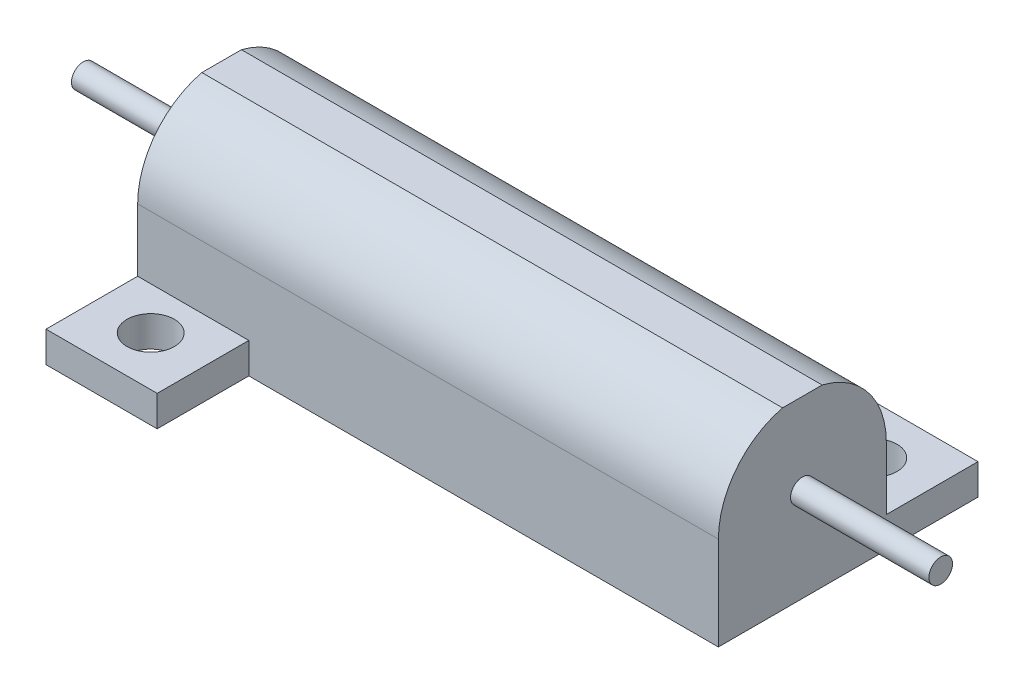
ISO-10303-21;
HEADER;
FILE_DESCRIPTION(('STEP AP214'),'2;1');
FILE_NAME('part.step','',(''),(''),'','','');
FILE_SCHEMA(('AUTOMOTIVE_DESIGN { 1 0 10303 214 1 1 1 1 }'));
ENDSEC;
DATA;
#1=APPLICATION_CONTEXT('core data for automotive mechanical design processes');
#2=APPLICATION_PROTOCOL_DEFINITION('international standard','automotive_design',2000,#1);
#3=PRODUCT_CONTEXT('',#1,'mechanical');
#4=PRODUCT('Part','Part','',(#3));
#5=PRODUCT_RELATED_PRODUCT_CATEGORY('part','',(#4));
#6=PRODUCT_DEFINITION_FORMATION('','',#4);
#7=PRODUCT_DEFINITION_CONTEXT('part definition',#1,'design');
#8=PRODUCT_DEFINITION('design','',#6,#7);
#9=PRODUCT_DEFINITION_SHAPE('','',#8);
#10=(LENGTH_UNIT() NAMED_UNIT(*) SI_UNIT(.MILLI.,.METRE.));
#11=(NAMED_UNIT(*) PLANE_ANGLE_UNIT() SI_UNIT($,.RADIAN.));
#12=(NAMED_UNIT(*) SI_UNIT($,.STERADIAN.) SOLID_ANGLE_UNIT());
#13=UNCERTAINTY_MEASURE_WITH_UNIT(LENGTH_MEASURE(1.E-05),#10,'distance_accuracy_value','');
#14=(GEOMETRIC_REPRESENTATION_CONTEXT(3) GLOBAL_UNCERTAINTY_ASSIGNED_CONTEXT((#13)) GLOBAL_UNIT_ASSIGNED_CONTEXT((#10,
#11,#12)) REPRESENTATION_CONTEXT('',''));
#15=CARTESIAN_POINT('',(0.,0.,0.));
#16=DIRECTION('',(0.,0.,1.));
#17=DIRECTION('',(1.,0.,0.));
#18=AXIS2_PLACEMENT_3D('',#15,#16,#17);
#19=CARTESIAN_POINT('',(0.,2.6,0.));
#20=DIRECTION('',(0.,-1.,0.));
#21=DIRECTION('',(0.,0.,-1.));
#22=AXIS2_PLACEMENT_3D('',#19,#20,#21);
#23=PLANE('',#22);
#24=CARTESIAN_POINT('',(44.4,2.6,-25.55));
#25=DIRECTION('',(0.,-1.,0.));
#26=DIRECTION('',(0.,0.,-1.));
#27=AXIS2_PLACEMENT_3D('',#24,#25,#26);
#28=CIRCLE('',#27,2.);
#29=CARTESIAN_POINT('',(44.4,2.6,-27.55));
#30=VERTEX_POINT('',#29);
#31=EDGE_CURVE('E140',#30,#30,#28,.T.);
#32=ORIENTED_EDGE('',*,*,#31,.T.);
#33=EDGE_LOOP('',(#32));
#34=FACE_BOUND('',#33,.T.);
#35=DIRECTION('',(-1.,0.,0.));
#36=VECTOR('',#35,1.);
#37=CARTESIAN_POINT('',(0.,2.6,-21.95));
#38=LINE('',#37,#36);
#39=CARTESIAN_POINT('',(49.1,2.6,-21.95));
#40=VERTEX_POINT('',#39);
#41=CARTESIAN_POINT('',(39.7,2.6,-21.95));
#42=VERTEX_POINT('',#41);
#43=EDGE_CURVE('E115',#40,#42,#38,.T.);
#44=ORIENTED_EDGE('',*,*,#43,.F.);
#45=DIRECTION('',(0.,0.,1.));
#46=VECTOR('',#45,1.);
#47=CARTESIAN_POINT('',(49.1,2.6,-29.7));
#48=LINE('',#47,#46);
#49=CARTESIAN_POINT('',(49.1,2.6,-29.7));
#50=VERTEX_POINT('',#49);
#51=EDGE_CURVE('E127',#50,#40,#48,.T.);
#52=ORIENTED_EDGE('',*,*,#51,.F.);
#53=DIRECTION('',(1.,0.,0.));
#54=VECTOR('',#53,1.);
#55=CARTESIAN_POINT('',(39.7,2.6,-29.7));
#56=LINE('',#55,#54);
#57=CARTESIAN_POINT('',(39.7,2.6,-29.7));
#58=VERTEX_POINT('',#57);
#59=EDGE_CURVE('E132',#58,#50,#56,.T.);
#60=ORIENTED_EDGE('',*,*,#59,.F.);
#61=DIRECTION('',(0.,0.,-1.));
#62=VECTOR('',#61,1.);
#63=CARTESIAN_POINT('',(39.7,2.6,-21.95));
#64=LINE('',#63,#62);
#65=EDGE_CURVE('E229',#42,#58,#64,.T.);
#66=ORIENTED_EDGE('',*,*,#65,.F.);
#67=EDGE_LOOP('',(#44,#52,#60,#66));
#68=FACE_BOUND('',#67,.T.);
#69=ADVANCED_FACE('F34',(#34,#68),#23,.F.);
#70=CARTESIAN_POINT('',(4.7,2.6,-4.15));
#71=DIRECTION('',(0.,-1.,0.));
#72=DIRECTION('',(0.,0.,-1.));
#73=AXIS2_PLACEMENT_3D('',#70,#71,#72);
#74=CIRCLE('',#73,2.);
#75=CARTESIAN_POINT('',(4.7,2.6,-6.15));
#76=VERTEX_POINT('',#75);
#77=EDGE_CURVE('E221',#76,#76,#74,.T.);
#78=ORIENTED_EDGE('',*,*,#77,.T.);
#79=EDGE_LOOP('',(#78));
#80=FACE_BOUND('',#79,.T.);
#81=DIRECTION('',(1.,0.,0.));
#82=VECTOR('',#81,1.);
#83=CARTESIAN_POINT('',(0.,2.6,-7.75));
#84=LINE('',#83,#82);
#85=CARTESIAN_POINT('',(0.,2.6,-7.75));
#86=VERTEX_POINT('',#85);
#87=CARTESIAN_POINT('',(9.4,2.6,-7.75));
#88=VERTEX_POINT('',#87);
#89=EDGE_CURVE('E104',#86,#88,#84,.T.);
#90=ORIENTED_EDGE('',*,*,#89,.F.);
#91=DIRECTION('',(0.,0.,-1.));
#92=VECTOR('',#91,1.);
#93=CARTESIAN_POINT('',(0.,2.6,0.));
#94=LINE('',#93,#92);
#95=CARTESIAN_POINT('',(0.,2.6,0.));
#96=VERTEX_POINT('',#95);
#97=EDGE_CURVE('E158',#96,#86,#94,.T.);
#98=ORIENTED_EDGE('',*,*,#97,.F.);
#99=DIRECTION('',(-1.,0.,0.));
#100=VECTOR('',#99,1.);
#101=CARTESIAN_POINT('',(9.4,2.6,0.));
#102=LINE('',#101,#100);
#103=CARTESIAN_POINT('',(9.4,2.6,0.));
#104=VERTEX_POINT('',#103);
#105=EDGE_CURVE('E126',#104,#96,#102,.T.);
#106=ORIENTED_EDGE('',*,*,#105,.F.);
#107=DIRECTION('',(0.,0.,1.));
#108=VECTOR('',#107,1.);
#109=CARTESIAN_POINT('',(9.4,2.6,-7.75));
#110=LINE('',#109,#108);
#111=EDGE_CURVE('E119',#88,#104,#110,.T.);
#112=ORIENTED_EDGE('',*,*,#111,.F.);
#113=EDGE_LOOP('',(#90,#98,#106,#112));
#114=FACE_BOUND('',#113,.T.);
#115=ADVANCED_FACE('F125',(#80,#114),#23,.F.);
#116=CARTESIAN_POINT('',(0.,2.6,0.));
#117=DIRECTION('',(-1.,0.,0.));
#118=DIRECTION('',(0.,0.,1.));
#119=AXIS2_PLACEMENT_3D('',#116,#117,#118);
#120=PLANE('',#119);
#121=CARTESIAN_POINT('',(0.,7.9,-14.85));
#122=DIRECTION('',(-1.,0.,0.));
#123=DIRECTION('',(0.,0.,1.));
#124=AXIS2_PLACEMENT_3D('',#121,#122,#123);
#125=CIRCLE('',#124,0.999999999999999);
#126=CARTESIAN_POINT('',(0.,7.9,-13.85));
#127=VERTEX_POINT('',#126);
#128=EDGE_CURVE('E11',#127,#127,#125,.T.);
#129=ORIENTED_EDGE('',*,*,#128,.F.);
#130=EDGE_LOOP('',(#129));
#131=FACE_BOUND('',#130,.T.);
#132=DIRECTION('',(0.,-1.,0.));
#133=VECTOR('',#132,1.);
#134=CARTESIAN_POINT('',(0.,7.9,-7.75));
#135=LINE('',#134,#133);
#136=CARTESIAN_POINT('',(0.,7.9,-7.75));
#137=VERTEX_POINT('',#136);
#138=EDGE_CURVE('E112',#137,#86,#135,.T.);
#139=ORIENTED_EDGE('',*,*,#138,.F.);
#140=CARTESIAN_POINT('',(0.,7.9,-14.85));
#141=DIRECTION('',(1.,0.,0.));
#142=DIRECTION('',(0.,0.,-1.));
#143=AXIS2_PLACEMENT_3D('',#140,#141,#142);
#144=CIRCLE('',#143,7.1);
#145=CARTESIAN_POINT('',(0.,14.8,-13.1766799469319));
#146=VERTEX_POINT('',#145);
#147=EDGE_CURVE('E286',#146,#137,#144,.T.);
#148=ORIENTED_EDGE('',*,*,#147,.F.);
#149=DIRECTION('',(0.,0.,-1.));
#150=VECTOR('',#149,1.);
#151=CARTESIAN_POINT('',(0.,14.8,-13.1766799469319));
#152=LINE('',#151,#150);
#153=CARTESIAN_POINT('',(0.,14.8,-16.5233200530681));
#154=VERTEX_POINT('',#153);
#155=EDGE_CURVE('E273',#146,#154,#152,.T.);
#156=ORIENTED_EDGE('',*,*,#155,.T.);
#157=CARTESIAN_POINT('',(0.,7.9,-21.95));
#158=VERTEX_POINT('',#157);
#159=EDGE_CURVE('E172',#158,#154,#144,.T.);
#160=ORIENTED_EDGE('',*,*,#159,.F.);
#161=DIRECTION('',(0.,-1.,0.));
#162=VECTOR('',#161,1.);
#163=CARTESIAN_POINT('',(0.,2.6,-21.95));
#164=LINE('',#163,#162);
#165=CARTESIAN_POINT('',(0.,0.,-21.95));
#166=VERTEX_POINT('',#165);
#167=EDGE_CURVE('E129',#158,#166,#164,.T.);
#168=ORIENTED_EDGE('',*,*,#167,.T.);
#169=DIRECTION('',(0.,0.,-1.));
#170=VECTOR('',#169,1.);
#171=CARTESIAN_POINT('',(0.,0.,0.));
#172=LINE('',#171,#170);
#173=CARTESIAN_POINT('',(0.,0.,0.));
#174=VERTEX_POINT('',#173);
#175=EDGE_CURVE('E136',#174,#166,#172,.T.);
#176=ORIENTED_EDGE('',*,*,#175,.F.);
#177=DIRECTION('',(0.,-1.,0.));
#178=VECTOR('',#177,1.);
#179=CARTESIAN_POINT('',(0.,2.6,0.));
#180=LINE('',#179,#178);
#181=EDGE_CURVE('E52',#96,#174,#180,.T.);
#182=ORIENTED_EDGE('',*,*,#181,.F.);
#183=ORIENTED_EDGE('',*,*,#97,.T.);
#184=EDGE_LOOP('',(#139,#148,#156,#160,#168,#176,#182,#183));
#185=FACE_BOUND('',#184,.T.);
#186=ADVANCED_FACE('F36',(#131,#185),#120,.T.);
#187=CARTESIAN_POINT('',(9.4,2.6,0.));
#188=DIRECTION('',(0.,0.,1.));
#189=DIRECTION('',(1.,0.,0.));
#190=AXIS2_PLACEMENT_3D('',#187,#188,#189);
#191=PLANE('',#190);
#192=DIRECTION('',(-1.,0.,0.));
#193=VECTOR('',#192,1.);
#194=CARTESIAN_POINT('',(9.4,0.,0.));
#195=LINE('',#194,#193);
#196=CARTESIAN_POINT('',(9.4,0.,0.));
#197=VERTEX_POINT('',#196);
#198=EDGE_CURVE('E155',#197,#174,#195,.T.);
#199=ORIENTED_EDGE('',*,*,#198,.F.);
#200=DIRECTION('',(0.,-1.,0.));
#201=VECTOR('',#200,1.);
#202=CARTESIAN_POINT('',(9.4,2.6,0.));
#203=LINE('',#202,#201);
#204=EDGE_CURVE('E82',#104,#197,#203,.T.);
#205=ORIENTED_EDGE('',*,*,#204,.F.);
#206=ORIENTED_EDGE('',*,*,#105,.T.);
#207=ORIENTED_EDGE('',*,*,#181,.T.);
#208=EDGE_LOOP('',(#199,#205,#206,#207));
#209=FACE_BOUND('',#208,.T.);
#210=ADVANCED_FACE('F182',(#209),#191,.T.);
#211=CARTESIAN_POINT('',(9.4,2.6,-7.75));
#212=DIRECTION('',(1.,0.,0.));
#213=DIRECTION('',(0.,0.,-1.));
#214=AXIS2_PLACEMENT_3D('',#211,#212,#213);
#215=PLANE('',#214);
#216=DIRECTION('',(0.,0.,1.));
#217=VECTOR('',#216,1.);
#218=CARTESIAN_POINT('',(9.4,0.,-7.75));
#219=LINE('',#218,#217);
#220=CARTESIAN_POINT('',(9.4,0.,-7.75));
#221=VERTEX_POINT('',#220);
#222=EDGE_CURVE('E121',#221,#197,#219,.T.);
#223=ORIENTED_EDGE('',*,*,#222,.F.);
#224=DIRECTION('',(0.,-1.,0.));
#225=VECTOR('',#224,1.);
#226=CARTESIAN_POINT('',(9.4,2.6,-7.75));
#227=LINE('',#226,#225);
#228=EDGE_CURVE('E108',#88,#221,#227,.T.);
#229=ORIENTED_EDGE('',*,*,#228,.F.);
#230=ORIENTED_EDGE('',*,*,#111,.T.);
#231=ORIENTED_EDGE('',*,*,#204,.T.);
#232=EDGE_LOOP('',(#223,#229,#230,#231));
#233=FACE_BOUND('',#232,.T.);
#234=ADVANCED_FACE('F118',(#233),#215,.T.);
#235=CARTESIAN_POINT('',(49.1,2.6,-7.75));
#236=DIRECTION('',(0.,0.,1.));
#237=DIRECTION('',(1.,0.,0.));
#238=AXIS2_PLACEMENT_3D('',#235,#236,#237);
#239=PLANE('',#238);
#240=DIRECTION('',(-1.,0.,0.));
#241=VECTOR('',#240,1.);
#242=CARTESIAN_POINT('',(49.1,0.,-7.75));
#243=LINE('',#242,#241);
#244=CARTESIAN_POINT('',(49.1,0.,-7.75));
#245=VERTEX_POINT('',#244);
#246=EDGE_CURVE('E152',#245,#221,#243,.T.);
#247=ORIENTED_EDGE('',*,*,#246,.F.);
#248=DIRECTION('',(0.,-1.,0.));
#249=VECTOR('',#248,1.);
#250=CARTESIAN_POINT('',(49.1,2.6,-7.75));
#251=LINE('',#250,#249);
#252=CARTESIAN_POINT('',(49.1,7.9,-7.75));
#253=VERTEX_POINT('',#252);
#254=EDGE_CURVE('E123',#253,#245,#251,.T.);
#255=ORIENTED_EDGE('',*,*,#254,.F.);
#256=DIRECTION('',(1.,0.,0.));
#257=VECTOR('',#256,1.);
#258=CARTESIAN_POINT('',(0.,7.9,-7.75));
#259=LINE('',#258,#257);
#260=EDGE_CURVE('E290',#137,#253,#259,.T.);
#261=ORIENTED_EDGE('',*,*,#260,.F.);
#262=ORIENTED_EDGE('',*,*,#138,.T.);
#263=ORIENTED_EDGE('',*,*,#89,.T.);
#264=ORIENTED_EDGE('',*,*,#228,.T.);
#265=EDGE_LOOP('',(#247,#255,#261,#262,#263,#264));
#266=FACE_BOUND('',#265,.T.);
#267=ADVANCED_FACE('F107',(#266),#239,.T.);
#268=CARTESIAN_POINT('',(49.1,2.6,-29.7));
#269=DIRECTION('',(1.,0.,0.));
#270=DIRECTION('',(0.,0.,-1.));
#271=AXIS2_PLACEMENT_3D('',#268,#269,#270);
#272=PLANE('',#271);
#273=CARTESIAN_POINT('',(49.1,7.9,-14.85));
#274=DIRECTION('',(1.,0.,0.));
#275=DIRECTION('',(0.,0.,-1.));
#276=AXIS2_PLACEMENT_3D('',#273,#274,#275);
#277=CIRCLE('',#276,0.999999999999999);
#278=CARTESIAN_POINT('',(49.1,7.9,-15.85));
#279=VERTEX_POINT('',#278);
#280=EDGE_CURVE('E38',#279,#279,#277,.T.);
#281=ORIENTED_EDGE('',*,*,#280,.F.);
#282=EDGE_LOOP('',(#281));
#283=FACE_BOUND('',#282,.T.);
#284=DIRECTION('',(0.,-1.,0.));
#285=VECTOR('',#284,1.);
#286=CARTESIAN_POINT('',(49.1,7.9,-21.95));
#287=LINE('',#286,#285);
#288=CARTESIAN_POINT('',(49.1,7.9,-21.95));
#289=VERTEX_POINT('',#288);
#290=EDGE_CURVE('E247',#289,#40,#287,.T.);
#291=ORIENTED_EDGE('',*,*,#290,.F.);
#292=CARTESIAN_POINT('',(49.1,7.9,-14.85));
#293=DIRECTION('',(1.,0.,0.));
#294=DIRECTION('',(0.,0.,-1.));
#295=AXIS2_PLACEMENT_3D('',#292,#293,#294);
#296=CIRCLE('',#295,7.1);
#297=CARTESIAN_POINT('',(49.1,14.8,-16.5233200530681));
#298=VERTEX_POINT('',#297);
#299=EDGE_CURVE('E265',#289,#298,#296,.T.);
#300=ORIENTED_EDGE('',*,*,#299,.T.);
#301=DIRECTION('',(0.,0.,-1.));
#302=VECTOR('',#301,1.);
#303=CARTESIAN_POINT('',(49.1,14.8,-13.1766799469319));
#304=LINE('',#303,#302);
#305=CARTESIAN_POINT('',(49.1,14.8,-13.1766799469319));
#306=VERTEX_POINT('',#305);
#307=EDGE_CURVE('E270',#306,#298,#304,.T.);
#308=ORIENTED_EDGE('',*,*,#307,.F.);
#309=EDGE_CURVE('E272',#306,#253,#296,.T.);
#310=ORIENTED_EDGE('',*,*,#309,.T.);
#311=ORIENTED_EDGE('',*,*,#254,.T.);
#312=DIRECTION('',(0.,0.,1.));
#313=VECTOR('',#312,1.);
#314=CARTESIAN_POINT('',(49.1,0.,-29.7));
#315=LINE('',#314,#313);
#316=CARTESIAN_POINT('',(49.1,0.,-29.7));
#317=VERTEX_POINT('',#316);
#318=EDGE_CURVE('E149',#317,#245,#315,.T.);
#319=ORIENTED_EDGE('',*,*,#318,.F.);
#320=DIRECTION('',(0.,-1.,0.));
#321=VECTOR('',#320,1.);
#322=CARTESIAN_POINT('',(49.1,2.6,-29.7));
#323=LINE('',#322,#321);
#324=EDGE_CURVE('E162',#50,#317,#323,.T.);
#325=ORIENTED_EDGE('',*,*,#324,.F.);
#326=ORIENTED_EDGE('',*,*,#51,.T.);
#327=EDGE_LOOP('',(#291,#300,#308,#310,#311,#319,#325,#326));
#328=FACE_BOUND('',#327,.T.);
#329=ADVANCED_FACE('F267',(#283,#328),#272,.T.);
#330=CARTESIAN_POINT('',(39.7,2.6,-29.7));
#331=DIRECTION('',(0.,0.,-1.));
#332=DIRECTION('',(-1.,0.,0.));
#333=AXIS2_PLACEMENT_3D('',#330,#331,#332);
#334=PLANE('',#333);
#335=DIRECTION('',(1.,0.,0.));
#336=VECTOR('',#335,1.);
#337=CARTESIAN_POINT('',(39.7,0.,-29.7));
#338=LINE('',#337,#336);
#339=CARTESIAN_POINT('',(39.7,0.,-29.7));
#340=VERTEX_POINT('',#339);
#341=EDGE_CURVE('E146',#340,#317,#338,.T.);
#342=ORIENTED_EDGE('',*,*,#341,.F.);
#343=DIRECTION('',(0.,-1.,0.));
#344=VECTOR('',#343,1.);
#345=CARTESIAN_POINT('',(39.7,2.6,-29.7));
#346=LINE('',#345,#344);
#347=EDGE_CURVE('E94',#58,#340,#346,.T.);
#348=ORIENTED_EDGE('',*,*,#347,.F.);
#349=ORIENTED_EDGE('',*,*,#59,.T.);
#350=ORIENTED_EDGE('',*,*,#324,.T.);
#351=EDGE_LOOP('',(#342,#348,#349,#350));
#352=FACE_BOUND('',#351,.T.);
#353=ADVANCED_FACE('F231',(#352),#334,.T.);
#354=CARTESIAN_POINT('',(39.7,2.6,-21.95));
#355=DIRECTION('',(-1.,0.,0.));
#356=DIRECTION('',(0.,0.,1.));
#357=AXIS2_PLACEMENT_3D('',#354,#355,#356);
#358=PLANE('',#357);
#359=DIRECTION('',(0.,0.,-1.));
#360=VECTOR('',#359,1.);
#361=CARTESIAN_POINT('',(39.7,0.,-21.95));
#362=LINE('',#361,#360);
#363=CARTESIAN_POINT('',(39.7,0.,-21.95));
#364=VERTEX_POINT('',#363);
#365=EDGE_CURVE('E143',#364,#340,#362,.T.);
#366=ORIENTED_EDGE('',*,*,#365,.F.);
#367=DIRECTION('',(0.,-1.,0.));
#368=VECTOR('',#367,1.);
#369=CARTESIAN_POINT('',(39.7,2.6,-21.95));
#370=LINE('',#369,#368);
#371=EDGE_CURVE('E165',#42,#364,#370,.T.);
#372=ORIENTED_EDGE('',*,*,#371,.F.);
#373=ORIENTED_EDGE('',*,*,#65,.T.);
#374=ORIENTED_EDGE('',*,*,#347,.T.);
#375=EDGE_LOOP('',(#366,#372,#373,#374));
#376=FACE_BOUND('',#375,.T.);
#377=ADVANCED_FACE('F212',(#376),#358,.T.);
#378=CARTESIAN_POINT('',(0.,2.6,-21.95));
#379=DIRECTION('',(0.,0.,-1.));
#380=DIRECTION('',(-1.,0.,0.));
#381=AXIS2_PLACEMENT_3D('',#378,#379,#380);
#382=PLANE('',#381);
#383=DIRECTION('',(1.,0.,0.));
#384=VECTOR('',#383,1.);
#385=CARTESIAN_POINT('',(0.,0.,-21.95));
#386=LINE('',#385,#384);
#387=EDGE_CURVE('E139',#166,#364,#386,.T.);
#388=ORIENTED_EDGE('',*,*,#387,.F.);
#389=ORIENTED_EDGE('',*,*,#167,.F.);
#390=DIRECTION('',(-1.,0.,0.));
#391=VECTOR('',#390,1.);
#392=CARTESIAN_POINT('',(0.,7.9,-21.95));
#393=LINE('',#392,#391);
#394=EDGE_CURVE('E292',#289,#158,#393,.T.);
#395=ORIENTED_EDGE('',*,*,#394,.F.);
#396=ORIENTED_EDGE('',*,*,#290,.T.);
#397=ORIENTED_EDGE('',*,*,#43,.T.);
#398=ORIENTED_EDGE('',*,*,#371,.T.);
#399=EDGE_LOOP('',(#388,#389,#395,#396,#397,#398));
#400=FACE_BOUND('',#399,.T.);
#401=ADVANCED_FACE('F176',(#400),#382,.T.);
#402=CARTESIAN_POINT('',(0.,0.,0.));
#403=DIRECTION('',(0.,-1.,0.));
#404=DIRECTION('',(0.,0.,-1.));
#405=AXIS2_PLACEMENT_3D('',#402,#403,#404);
#406=PLANE('',#405);
#407=CARTESIAN_POINT('',(44.4,0.,-25.55));
#408=DIRECTION('',(0.,-1.,0.));
#409=DIRECTION('',(0.,0.,-1.));
#410=AXIS2_PLACEMENT_3D('',#407,#408,#409);
#411=CIRCLE('',#410,2.);
#412=CARTESIAN_POINT('',(44.4,0.,-27.55));
#413=VERTEX_POINT('',#412);
#414=EDGE_CURVE('E216',#413,#413,#411,.T.);
#415=ORIENTED_EDGE('',*,*,#414,.F.);
#416=EDGE_LOOP('',(#415));
#417=FACE_BOUND('',#416,.T.);
#418=CARTESIAN_POINT('',(4.7,0.,-4.15));
#419=DIRECTION('',(0.,-1.,0.));
#420=DIRECTION('',(0.,0.,-1.));
#421=AXIS2_PLACEMENT_3D('',#418,#419,#420);
#422=CIRCLE('',#421,2.);
#423=CARTESIAN_POINT('',(4.7,0.,-6.15));
#424=VERTEX_POINT('',#423);
#425=EDGE_CURVE('E219',#424,#424,#422,.T.);
#426=ORIENTED_EDGE('',*,*,#425,.F.);
#427=EDGE_LOOP('',(#426));
#428=FACE_BOUND('',#427,.T.);
#429=ORIENTED_EDGE('',*,*,#175,.T.);
#430=ORIENTED_EDGE('',*,*,#387,.T.);
#431=ORIENTED_EDGE('',*,*,#365,.T.);
#432=ORIENTED_EDGE('',*,*,#341,.T.);
#433=ORIENTED_EDGE('',*,*,#318,.T.);
#434=ORIENTED_EDGE('',*,*,#246,.T.);
#435=ORIENTED_EDGE('',*,*,#222,.T.);
#436=ORIENTED_EDGE('',*,*,#198,.T.);
#437=EDGE_LOOP('',(#429,#430,#431,#432,#433,#434,#435,#436));
#438=FACE_BOUND('',#437,.T.);
#439=ADVANCED_FACE('F181',(#417,#428,#438),#406,.T.);
#440=CARTESIAN_POINT('',(4.7,2.6,-4.15));
#441=DIRECTION('',(0.,-1.,0.));
#442=DIRECTION('',(0.,0.,-1.));
#443=AXIS2_PLACEMENT_3D('',#440,#441,#442);
#444=CYLINDRICAL_SURFACE('',#443,2.);
#445=ORIENTED_EDGE('',*,*,#77,.F.);
#446=EDGE_LOOP('',(#445));
#447=FACE_BOUND('',#446,.T.);
#448=ORIENTED_EDGE('',*,*,#425,.T.);
#449=EDGE_LOOP('',(#448));
#450=FACE_BOUND('',#449,.T.);
#451=ADVANCED_FACE('F202',(#447,#450),#444,.F.);
#452=CARTESIAN_POINT('',(44.4,2.6,-25.55));
#453=DIRECTION('',(0.,-1.,0.));
#454=DIRECTION('',(0.,0.,-1.));
#455=AXIS2_PLACEMENT_3D('',#452,#453,#454);
#456=CYLINDRICAL_SURFACE('',#455,2.);
#457=ORIENTED_EDGE('',*,*,#31,.F.);
#458=EDGE_LOOP('',(#457));
#459=FACE_BOUND('',#458,.T.);
#460=ORIENTED_EDGE('',*,*,#414,.T.);
#461=EDGE_LOOP('',(#460));
#462=FACE_BOUND('',#461,.T.);
#463=ADVANCED_FACE('F210',(#459,#462),#456,.F.);
#464=CARTESIAN_POINT('',(49.1,7.9,-14.85));
#465=DIRECTION('',(-1.,0.,0.));
#466=DIRECTION('',(0.,0.,1.));
#467=AXIS2_PLACEMENT_3D('',#464,#465,#466);
#468=CYLINDRICAL_SURFACE('',#467,7.1);
#469=ORIENTED_EDGE('',*,*,#147,.T.);
#470=ORIENTED_EDGE('',*,*,#260,.T.);
#471=ORIENTED_EDGE('',*,*,#309,.F.);
#472=DIRECTION('',(-1.,0.,0.));
#473=VECTOR('',#472,1.);
#474=CARTESIAN_POINT('',(49.1,14.8,-13.1766799469319));
#475=LINE('',#474,#473);
#476=EDGE_CURVE('E279',#306,#146,#475,.T.);
#477=ORIENTED_EDGE('',*,*,#476,.T.);
#478=EDGE_LOOP('',(#469,#470,#471,#477));
#479=FACE_BOUND('',#478,.T.);
#480=ADVANCED_FACE('F300',(#479),#468,.T.);
#481=ORIENTED_EDGE('',*,*,#299,.F.);
#482=ORIENTED_EDGE('',*,*,#394,.T.);
#483=ORIENTED_EDGE('',*,*,#159,.T.);
#484=DIRECTION('',(-1.,0.,0.));
#485=VECTOR('',#484,1.);
#486=CARTESIAN_POINT('',(49.1,14.8,-16.5233200530681));
#487=LINE('',#486,#485);
#488=EDGE_CURVE('E116',#298,#154,#487,.T.);
#489=ORIENTED_EDGE('',*,*,#488,.F.);
#490=EDGE_LOOP('',(#481,#482,#483,#489));
#491=FACE_BOUND('',#490,.T.);
#492=ADVANCED_FACE('F276',(#491),#468,.T.);
#493=CARTESIAN_POINT('',(49.1,14.8,-13.1766799469319));
#494=DIRECTION('',(0.,1.,0.));
#495=DIRECTION('',(0.,0.,1.));
#496=AXIS2_PLACEMENT_3D('',#493,#494,#495);
#497=PLANE('',#496);
#498=ORIENTED_EDGE('',*,*,#155,.F.);
#499=ORIENTED_EDGE('',*,*,#476,.F.);
#500=ORIENTED_EDGE('',*,*,#307,.T.);
#501=ORIENTED_EDGE('',*,*,#488,.T.);
#502=EDGE_LOOP('',(#498,#499,#500,#501));
#503=FACE_BOUND('',#502,.T.);
#504=ADVANCED_FACE('F281',(#503),#497,.T.);
#505=CARTESIAN_POINT('',(60.8,7.9,-14.85));
#506=DIRECTION('',(-1.,0.,0.));
#507=DIRECTION('',(0.,0.,1.));
#508=AXIS2_PLACEMENT_3D('',#505,#506,#507);
#509=PLANE('',#508);
#510=CARTESIAN_POINT('',(60.8,7.9,-14.85));
#511=DIRECTION('',(-1.,0.,0.));
#512=DIRECTION('',(0.,0.,1.));
#513=AXIS2_PLACEMENT_3D('',#510,#511,#512);
#514=CIRCLE('',#513,0.999999999999999);
#515=CARTESIAN_POINT('',(60.8,7.9,-13.85));
#516=VERTEX_POINT('',#515);
#517=EDGE_CURVE('E329',#516,#516,#514,.T.);
#518=ORIENTED_EDGE('',*,*,#517,.F.);
#519=EDGE_LOOP('',(#518));
#520=FACE_BOUND('',#519,.T.);
#521=ADVANCED_FACE('F309',(#520),#509,.F.);
#522=CARTESIAN_POINT('',(60.8,7.9,-14.85));
#523=DIRECTION('',(-1.,0.,0.));
#524=DIRECTION('',(0.,0.,1.));
#525=AXIS2_PLACEMENT_3D('',#522,#523,#524);
#526=CYLINDRICAL_SURFACE('',#525,0.999999999999999);
#527=ORIENTED_EDGE('',*,*,#280,.T.);
#528=EDGE_LOOP('',(#527));
#529=FACE_BOUND('',#528,.T.);
#530=ORIENTED_EDGE('',*,*,#517,.T.);
#531=EDGE_LOOP('',(#530));
#532=FACE_BOUND('',#531,.T.);
#533=ADVANCED_FACE('F310',(#529,#532),#526,.T.);
#534=ORIENTED_EDGE('',*,*,#128,.T.);
#535=EDGE_LOOP('',(#534));
#536=FACE_BOUND('',#535,.T.);
#537=CARTESIAN_POINT('',(-11.7,7.9,-14.85));
#538=DIRECTION('',(-1.,0.,0.));
#539=DIRECTION('',(0.,0.,1.));
#540=AXIS2_PLACEMENT_3D('',#537,#538,#539);
#541=CIRCLE('',#540,0.999999999999999);
#542=CARTESIAN_POINT('',(-11.7,7.9,-13.85));
#543=VERTEX_POINT('',#542);
#544=EDGE_CURVE('E327',#543,#543,#541,.T.);
#545=ORIENTED_EDGE('',*,*,#544,.F.);
#546=EDGE_LOOP('',(#545));
#547=FACE_BOUND('',#546,.T.);
#548=ADVANCED_FACE('F313',(#536,#547),#526,.T.);
#549=CARTESIAN_POINT('',(-11.7,7.9,-14.85));
#550=DIRECTION('',(-1.,0.,0.));
#551=DIRECTION('',(0.,0.,1.));
#552=AXIS2_PLACEMENT_3D('',#549,#550,#551);
#553=PLANE('',#552);
#554=ORIENTED_EDGE('',*,*,#544,.T.);
#555=EDGE_LOOP('',(#554));
#556=FACE_BOUND('',#555,.T.);
#557=ADVANCED_FACE('F318',(#556),#553,.T.);
#558=CLOSED_SHELL('',(#69,#115,#186,#210,#234,#267,#329,#353,#377,#401,#439,#451,#463,#480,#492,
#504,#521,#533,#548,#557));
#559=MANIFOLD_SOLID_BREP('B2',#558);
#560=ADVANCED_BREP_SHAPE_REPRESENTATION('',(#18,#559),#14);
#561=SHAPE_DEFINITION_REPRESENTATION(#9,#560);
ENDSEC;
END-ISO-10303-21;
